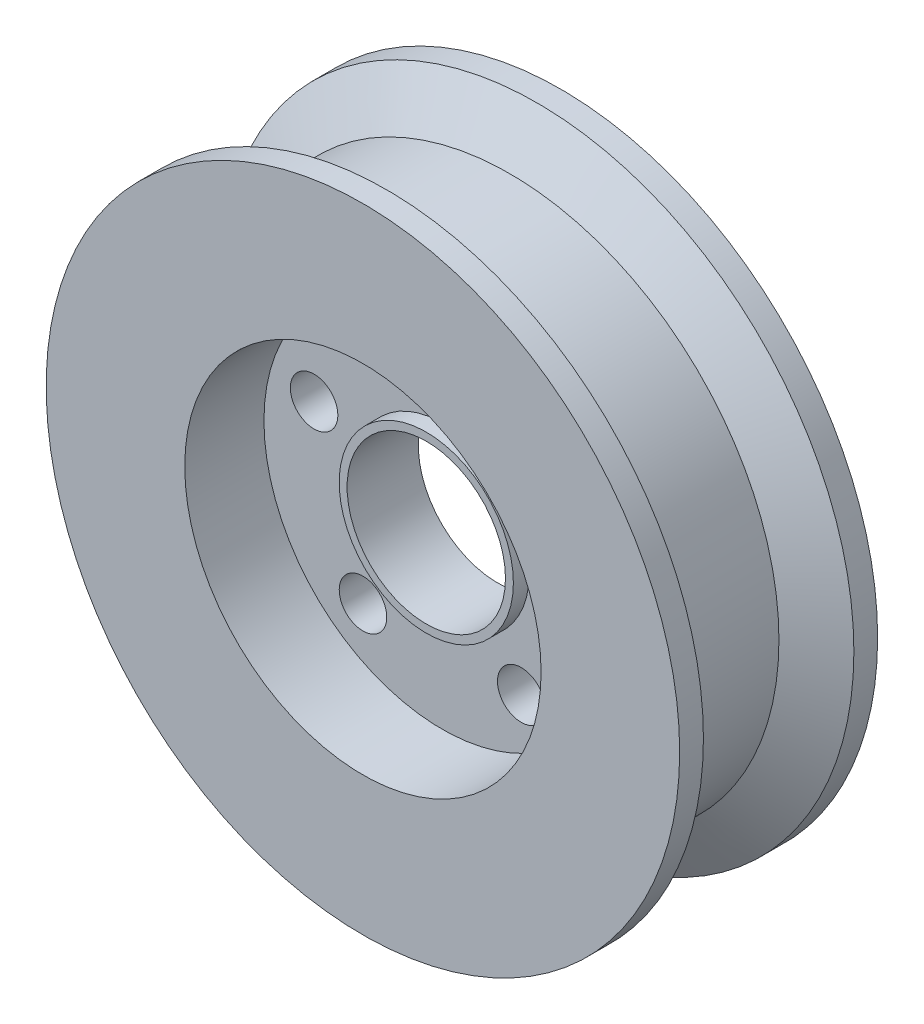
ISO-10303-21;
HEADER;
FILE_DESCRIPTION(('STEP AP214'),'2;1');
FILE_NAME('part.step','',(''),(''),'','','');
FILE_SCHEMA(('AUTOMOTIVE_DESIGN { 1 0 10303 214 1 1 1 1 }'));
ENDSEC;
DATA;
#1=APPLICATION_CONTEXT('core data for automotive mechanical design processes');
#2=APPLICATION_PROTOCOL_DEFINITION('international standard','automotive_design',2000,#1);
#3=PRODUCT_CONTEXT('',#1,'mechanical');
#4=PRODUCT('Part','Part','',(#3));
#5=PRODUCT_RELATED_PRODUCT_CATEGORY('part','',(#4));
#6=PRODUCT_DEFINITION_FORMATION('','',#4);
#7=PRODUCT_DEFINITION_CONTEXT('part definition',#1,'design');
#8=PRODUCT_DEFINITION('design','',#6,#7);
#9=PRODUCT_DEFINITION_SHAPE('','',#8);
#10=(LENGTH_UNIT() NAMED_UNIT(*) SI_UNIT(.MILLI.,.METRE.));
#11=(NAMED_UNIT(*) PLANE_ANGLE_UNIT() SI_UNIT($,.RADIAN.));
#12=(NAMED_UNIT(*) SI_UNIT($,.STERADIAN.) SOLID_ANGLE_UNIT());
#13=UNCERTAINTY_MEASURE_WITH_UNIT(LENGTH_MEASURE(1.E-05),#10,'distance_accuracy_value','');
#14=(GEOMETRIC_REPRESENTATION_CONTEXT(3) GLOBAL_UNCERTAINTY_ASSIGNED_CONTEXT((#13)) GLOBAL_UNIT_ASSIGNED_CONTEXT((#10,
#11,#12)) REPRESENTATION_CONTEXT('',''));
#15=CARTESIAN_POINT('',(0.,0.,0.));
#16=DIRECTION('',(0.,0.,1.));
#17=DIRECTION('',(1.,0.,0.));
#18=AXIS2_PLACEMENT_3D('',#15,#16,#17);
#19=CARTESIAN_POINT('',(0.,0.,12.5));
#20=DIRECTION('',(0.,0.,-1.));
#21=DIRECTION('',(-1.,0.,0.));
#22=AXIS2_PLACEMENT_3D('',#19,#20,#21);
#23=CYLINDRICAL_SURFACE('',#22,40.);
#24=CARTESIAN_POINT('',(0.,0.,-12.5));
#25=DIRECTION('',(0.,0.,1.));
#26=DIRECTION('',(1.,0.,0.));
#27=AXIS2_PLACEMENT_3D('',#24,#25,#26);
#28=CIRCLE('',#27,40.);
#29=CARTESIAN_POINT('',(40.,0.,-12.5));
#30=VERTEX_POINT('',#29);
#31=EDGE_CURVE('E95',#30,#30,#28,.T.);
#32=ORIENTED_EDGE('',*,*,#31,.T.);
#33=EDGE_LOOP('',(#32));
#34=FACE_BOUND('',#33,.T.);
#35=CARTESIAN_POINT('',(0.,0.,-9.5));
#36=DIRECTION('',(0.,0.,1.));
#37=DIRECTION('',(1.,0.,0.));
#38=AXIS2_PLACEMENT_3D('',#35,#36,#37);
#39=CIRCLE('',#38,40.);
#40=CARTESIAN_POINT('',(40.,0.,-9.5));
#41=VERTEX_POINT('',#40);
#42=EDGE_CURVE('E160',#41,#41,#39,.T.);
#43=ORIENTED_EDGE('',*,*,#42,.F.);
#44=EDGE_LOOP('',(#43));
#45=FACE_BOUND('',#44,.T.);
#46=ADVANCED_FACE('F41',(#34,#45),#23,.T.);
#47=CARTESIAN_POINT('',(0.,0.,12.5));
#48=DIRECTION('',(0.,0.,1.));
#49=DIRECTION('',(1.,0.,0.));
#50=AXIS2_PLACEMENT_3D('',#47,#48,#49);
#51=CIRCLE('',#50,40.);
#52=CARTESIAN_POINT('',(40.,0.,12.5));
#53=VERTEX_POINT('',#52);
#54=EDGE_CURVE('E54',#53,#53,#51,.T.);
#55=ORIENTED_EDGE('',*,*,#54,.F.);
#56=EDGE_LOOP('',(#55));
#57=FACE_BOUND('',#56,.T.);
#58=CARTESIAN_POINT('',(0.,0.,9.5));
#59=DIRECTION('',(0.,0.,1.));
#60=DIRECTION('',(1.,0.,0.));
#61=AXIS2_PLACEMENT_3D('',#58,#59,#60);
#62=CIRCLE('',#61,40.);
#63=CARTESIAN_POINT('',(40.,0.,9.5));
#64=VERTEX_POINT('',#63);
#65=EDGE_CURVE('E243',#64,#64,#62,.T.);
#66=ORIENTED_EDGE('',*,*,#65,.T.);
#67=EDGE_LOOP('',(#66));
#68=FACE_BOUND('',#67,.T.);
#69=ADVANCED_FACE('F157',(#57,#68),#23,.T.);
#70=CARTESIAN_POINT('',(0.,0.,12.5));
#71=DIRECTION('',(0.,0.,1.));
#72=DIRECTION('',(1.,0.,0.));
#73=AXIS2_PLACEMENT_3D('',#70,#71,#72);
#74=PLANE('',#73);
#75=CARTESIAN_POINT('',(0.,0.,12.5));
#76=DIRECTION('',(0.,0.,1.));
#77=DIRECTION('',(1.,0.,0.));
#78=AXIS2_PLACEMENT_3D('',#75,#76,#77);
#79=CIRCLE('',#78,22.5);
#80=CARTESIAN_POINT('',(22.5,0.,12.5));
#81=VERTEX_POINT('',#80);
#82=EDGE_CURVE('E86',#81,#81,#79,.T.);
#83=ORIENTED_EDGE('',*,*,#82,.F.);
#84=EDGE_LOOP('',(#83));
#85=FACE_BOUND('',#84,.T.);
#86=ORIENTED_EDGE('',*,*,#54,.T.);
#87=EDGE_LOOP('',(#86));
#88=FACE_BOUND('',#87,.T.);
#89=ADVANCED_FACE('F152',(#85,#88),#74,.T.);
#90=CARTESIAN_POINT('',(0.,0.,-12.5));
#91=DIRECTION('',(0.,0.,1.));
#92=DIRECTION('',(1.,0.,0.));
#93=AXIS2_PLACEMENT_3D('',#90,#91,#92);
#94=PLANE('',#93);
#95=CARTESIAN_POINT('',(0.,0.,-12.5));
#96=DIRECTION('',(0.,0.,1.));
#97=DIRECTION('',(1.,0.,0.));
#98=AXIS2_PLACEMENT_3D('',#95,#96,#97);
#99=CIRCLE('',#98,22.5);
#100=CARTESIAN_POINT('',(22.5,0.,-12.5));
#101=VERTEX_POINT('',#100);
#102=EDGE_CURVE('E87',#101,#101,#99,.T.);
#103=ORIENTED_EDGE('',*,*,#102,.T.);
#104=EDGE_LOOP('',(#103));
#105=FACE_BOUND('',#104,.T.);
#106=ORIENTED_EDGE('',*,*,#31,.F.);
#107=EDGE_LOOP('',(#106));
#108=FACE_BOUND('',#107,.T.);
#109=ADVANCED_FACE('F148',(#105,#108),#94,.F.);
#110=CARTESIAN_POINT('',(0.,0.,2.5));
#111=DIRECTION('',(0.,0.,1.));
#112=DIRECTION('',(1.,0.,0.));
#113=AXIS2_PLACEMENT_3D('',#110,#111,#112);
#114=CYLINDRICAL_SURFACE('',#113,22.5);
#115=CARTESIAN_POINT('',(0.,0.,2.5));
#116=DIRECTION('',(0.,0.,1.));
#117=DIRECTION('',(1.,0.,0.));
#118=AXIS2_PLACEMENT_3D('',#115,#116,#117);
#119=CIRCLE('',#118,22.5);
#120=CARTESIAN_POINT('',(22.5,0.,2.5));
#121=VERTEX_POINT('',#120);
#122=EDGE_CURVE('E91',#121,#121,#119,.T.);
#123=ORIENTED_EDGE('',*,*,#122,.F.);
#124=EDGE_LOOP('',(#123));
#125=FACE_BOUND('',#124,.T.);
#126=ORIENTED_EDGE('',*,*,#82,.T.);
#127=EDGE_LOOP('',(#126));
#128=FACE_BOUND('',#127,.T.);
#129=ADVANCED_FACE('F151',(#125,#128),#114,.F.);
#130=CARTESIAN_POINT('',(0.,0.,2.5));
#131=DIRECTION('',(0.,0.,1.));
#132=DIRECTION('',(1.,0.,0.));
#133=AXIS2_PLACEMENT_3D('',#130,#131,#132);
#134=PLANE('',#133);
#135=CARTESIAN_POINT('',(0.,0.,2.5));
#136=DIRECTION('',(0.,0.,1.));
#137=DIRECTION('',(1.,0.,0.));
#138=AXIS2_PLACEMENT_3D('',#135,#136,#137);
#139=CIRCLE('',#138,11.);
#140=CARTESIAN_POINT('',(11.,0.,2.5));
#141=VERTEX_POINT('',#140);
#142=EDGE_CURVE('E10',#141,#141,#139,.T.);
#143=ORIENTED_EDGE('',*,*,#142,.F.);
#144=EDGE_LOOP('',(#143));
#145=FACE_BOUND('',#144,.T.);
#146=CARTESIAN_POINT('',(-16.1679607770176,5.25328890437406,2.5));
#147=DIRECTION('',(0.,0.,1.));
#148=DIRECTION('',(0.309016994374945,0.951056516295155,0.));
#149=AXIS2_PLACEMENT_3D('',#146,#147,#148);
#150=CIRCLE('',#149,3.);
#151=CARTESIAN_POINT('',(-15.2409097938928,8.10645845325953,2.5));
#152=VERTEX_POINT('',#151);
#153=EDGE_CURVE('E59',#152,#152,#150,.T.);
#154=ORIENTED_EDGE('',*,*,#153,.F.);
#155=EDGE_LOOP('',(#154));
#156=FACE_BOUND('',#155,.T.);
#157=CARTESIAN_POINT('',(-9.99234928897197,-13.7532889043742,2.5));
#158=DIRECTION('',(0.,0.,1.));
#159=DIRECTION('',(-0.809016994374951,0.587785252292469,0.));
#160=AXIS2_PLACEMENT_3D('',#157,#158,#159);
#161=CIRCLE('',#160,3.);
#162=CARTESIAN_POINT('',(-12.4194002720968,-11.9899331474968,2.5));
#163=VERTEX_POINT('',#162);
#164=EDGE_CURVE('E64',#163,#163,#161,.T.);
#165=ORIENTED_EDGE('',*,*,#164,.F.);
#166=EDGE_LOOP('',(#165));
#167=FACE_BOUND('',#166,.T.);
#168=CARTESIAN_POINT('',(9.99234928897216,-13.753288904374,2.5));
#169=DIRECTION('',(0.,0.,1.));
#170=DIRECTION('',(-0.809016994374942,-0.58778525229248,0.));
#171=AXIS2_PLACEMENT_3D('',#168,#169,#170);
#172=CIRCLE('',#171,3.);
#173=CARTESIAN_POINT('',(7.56529830584734,-15.5166446612515,2.5));
#174=VERTEX_POINT('',#173);
#175=EDGE_CURVE('E68',#174,#174,#172,.T.);
#176=ORIENTED_EDGE('',*,*,#175,.F.);
#177=EDGE_LOOP('',(#176));
#178=FACE_BOUND('',#177,.T.);
#179=CARTESIAN_POINT('',(16.1679607770176,5.25328890437429,2.5));
#180=DIRECTION('',(0.,0.,1.));
#181=DIRECTION('',(0.309016994374958,-0.95105651629515,0.));
#182=AXIS2_PLACEMENT_3D('',#179,#180,#181);
#183=CIRCLE('',#182,3.);
#184=CARTESIAN_POINT('',(17.0950117601424,2.40011935548884,2.5));
#185=VERTEX_POINT('',#184);
#186=EDGE_CURVE('E72',#185,#185,#183,.T.);
#187=ORIENTED_EDGE('',*,*,#186,.F.);
#188=EDGE_LOOP('',(#187));
#189=FACE_BOUND('',#188,.T.);
#190=CARTESIAN_POINT('',(0.,17.,2.5));
#191=DIRECTION('',(0.,0.,1.));
#192=DIRECTION('',(1.,0.,0.));
#193=AXIS2_PLACEMENT_3D('',#190,#191,#192);
#194=CIRCLE('',#193,3.);
#195=CARTESIAN_POINT('',(3.,17.,2.5));
#196=VERTEX_POINT('',#195);
#197=EDGE_CURVE('E76',#196,#196,#194,.T.);
#198=ORIENTED_EDGE('',*,*,#197,.F.);
#199=EDGE_LOOP('',(#198));
#200=FACE_BOUND('',#199,.T.);
#201=ORIENTED_EDGE('',*,*,#122,.T.);
#202=EDGE_LOOP('',(#201));
#203=FACE_BOUND('',#202,.T.);
#204=ADVANCED_FACE('F144',(#145,#156,#167,#178,#189,#200,#203),#134,.T.);
#205=CARTESIAN_POINT('',(0.,0.,-2.5));
#206=DIRECTION('',(0.,0.,-1.));
#207=DIRECTION('',(-1.,0.,0.));
#208=AXIS2_PLACEMENT_3D('',#205,#206,#207);
#209=CYLINDRICAL_SURFACE('',#208,22.5);
#210=CARTESIAN_POINT('',(0.,0.,-2.5));
#211=DIRECTION('',(0.,0.,1.));
#212=DIRECTION('',(1.,0.,0.));
#213=AXIS2_PLACEMENT_3D('',#210,#211,#212);
#214=CIRCLE('',#213,22.5);
#215=CARTESIAN_POINT('',(22.5,0.,-2.5));
#216=VERTEX_POINT('',#215);
#217=EDGE_CURVE('E82',#216,#216,#214,.T.);
#218=ORIENTED_EDGE('',*,*,#217,.T.);
#219=EDGE_LOOP('',(#218));
#220=FACE_BOUND('',#219,.T.);
#221=ORIENTED_EDGE('',*,*,#102,.F.);
#222=EDGE_LOOP('',(#221));
#223=FACE_BOUND('',#222,.T.);
#224=ADVANCED_FACE('F129',(#220,#223),#209,.F.);
#225=CARTESIAN_POINT('',(0.,0.,-2.5));
#226=DIRECTION('',(0.,0.,-1.));
#227=DIRECTION('',(1.,0.,0.));
#228=AXIS2_PLACEMENT_3D('',#225,#226,#227);
#229=PLANE('',#228);
#230=CARTESIAN_POINT('',(0.,0.,-2.5));
#231=DIRECTION('',(0.,0.,-1.));
#232=DIRECTION('',(-1.,0.,0.));
#233=AXIS2_PLACEMENT_3D('',#230,#231,#232);
#234=CIRCLE('',#233,11.);
#235=CARTESIAN_POINT('',(-11.,0.,-2.5));
#236=VERTEX_POINT('',#235);
#237=EDGE_CURVE('E44',#236,#236,#234,.T.);
#238=ORIENTED_EDGE('',*,*,#237,.F.);
#239=EDGE_LOOP('',(#238));
#240=FACE_BOUND('',#239,.T.);
#241=CARTESIAN_POINT('',(-16.1679607770176,5.25328890437406,-2.5));
#242=DIRECTION('',(0.,0.,-1.));
#243=DIRECTION('',(-1.,0.,0.));
#244=AXIS2_PLACEMENT_3D('',#241,#242,#243);
#245=CIRCLE('',#244,3.);
#246=CARTESIAN_POINT('',(-19.1679607770176,5.25328890437406,-2.5));
#247=VERTEX_POINT('',#246);
#248=EDGE_CURVE('E81',#247,#247,#245,.T.);
#249=ORIENTED_EDGE('',*,*,#248,.F.);
#250=EDGE_LOOP('',(#249));
#251=FACE_BOUND('',#250,.T.);
#252=CARTESIAN_POINT('',(-9.99234928897197,-13.7532889043742,-2.5));
#253=DIRECTION('',(0.,0.,-1.));
#254=DIRECTION('',(-1.,0.,0.));
#255=AXIS2_PLACEMENT_3D('',#252,#253,#254);
#256=CIRCLE('',#255,3.);
#257=CARTESIAN_POINT('',(-12.992349288972,-13.7532889043742,-2.5));
#258=VERTEX_POINT('',#257);
#259=EDGE_CURVE('E115',#258,#258,#256,.T.);
#260=ORIENTED_EDGE('',*,*,#259,.F.);
#261=EDGE_LOOP('',(#260));
#262=FACE_BOUND('',#261,.T.);
#263=CARTESIAN_POINT('',(9.99234928897216,-13.753288904374,-2.5));
#264=DIRECTION('',(0.,0.,-1.));
#265=DIRECTION('',(-1.,0.,0.));
#266=AXIS2_PLACEMENT_3D('',#263,#264,#265);
#267=CIRCLE('',#266,3.);
#268=CARTESIAN_POINT('',(6.99234928897217,-13.753288904374,-2.5));
#269=VERTEX_POINT('',#268);
#270=EDGE_CURVE('E111',#269,#269,#267,.T.);
#271=ORIENTED_EDGE('',*,*,#270,.F.);
#272=EDGE_LOOP('',(#271));
#273=FACE_BOUND('',#272,.T.);
#274=CARTESIAN_POINT('',(16.1679607770176,5.25328890437429,-2.5));
#275=DIRECTION('',(0.,0.,-1.));
#276=DIRECTION('',(-1.,0.,0.));
#277=AXIS2_PLACEMENT_3D('',#274,#275,#276);
#278=CIRCLE('',#277,3.);
#279=CARTESIAN_POINT('',(13.1679607770176,5.25328890437429,-2.5));
#280=VERTEX_POINT('',#279);
#281=EDGE_CURVE('E63',#280,#280,#278,.T.);
#282=ORIENTED_EDGE('',*,*,#281,.F.);
#283=EDGE_LOOP('',(#282));
#284=FACE_BOUND('',#283,.T.);
#285=CARTESIAN_POINT('',(0.,17.,-2.5));
#286=DIRECTION('',(0.,0.,-1.));
#287=DIRECTION('',(-1.,0.,0.));
#288=AXIS2_PLACEMENT_3D('',#285,#286,#287);
#289=CIRCLE('',#288,3.);
#290=CARTESIAN_POINT('',(-3.,17.,-2.5));
#291=VERTEX_POINT('',#290);
#292=EDGE_CURVE('E80',#291,#291,#289,.T.);
#293=ORIENTED_EDGE('',*,*,#292,.F.);
#294=EDGE_LOOP('',(#293));
#295=FACE_BOUND('',#294,.T.);
#296=ORIENTED_EDGE('',*,*,#217,.F.);
#297=EDGE_LOOP('',(#296));
#298=FACE_BOUND('',#297,.T.);
#299=ADVANCED_FACE('F125',(#240,#251,#262,#273,#284,#295,#298),#229,.T.);
#300=CARTESIAN_POINT('',(0.,17.,-12.5));
#301=DIRECTION('',(0.,0.,1.));
#302=DIRECTION('',(1.,0.,0.));
#303=AXIS2_PLACEMENT_3D('',#300,#301,#302);
#304=CYLINDRICAL_SURFACE('',#303,3.);
#305=ORIENTED_EDGE('',*,*,#292,.T.);
#306=EDGE_LOOP('',(#305));
#307=FACE_BOUND('',#306,.T.);
#308=ORIENTED_EDGE('',*,*,#197,.T.);
#309=EDGE_LOOP('',(#308));
#310=FACE_BOUND('',#309,.T.);
#311=ADVANCED_FACE('F128',(#307,#310),#304,.F.);
#312=CARTESIAN_POINT('',(16.1679607770176,5.25328890437429,-12.5));
#313=DIRECTION('',(0.,0.,1.));
#314=DIRECTION('',(1.,0.,0.));
#315=AXIS2_PLACEMENT_3D('',#312,#313,#314);
#316=CYLINDRICAL_SURFACE('',#315,3.);
#317=ORIENTED_EDGE('',*,*,#281,.T.);
#318=EDGE_LOOP('',(#317));
#319=FACE_BOUND('',#318,.T.);
#320=ORIENTED_EDGE('',*,*,#186,.T.);
#321=EDGE_LOOP('',(#320));
#322=FACE_BOUND('',#321,.T.);
#323=ADVANCED_FACE('F212',(#319,#322),#316,.F.);
#324=CARTESIAN_POINT('',(9.99234928897216,-13.753288904374,-12.5));
#325=DIRECTION('',(0.,0.,1.));
#326=DIRECTION('',(1.,0.,0.));
#327=AXIS2_PLACEMENT_3D('',#324,#325,#326);
#328=CYLINDRICAL_SURFACE('',#327,3.);
#329=ORIENTED_EDGE('',*,*,#270,.T.);
#330=EDGE_LOOP('',(#329));
#331=FACE_BOUND('',#330,.T.);
#332=ORIENTED_EDGE('',*,*,#175,.T.);
#333=EDGE_LOOP('',(#332));
#334=FACE_BOUND('',#333,.T.);
#335=ADVANCED_FACE('F208',(#331,#334),#328,.F.);
#336=CARTESIAN_POINT('',(-9.99234928897197,-13.7532889043742,-12.5));
#337=DIRECTION('',(0.,0.,1.));
#338=DIRECTION('',(1.,0.,0.));
#339=AXIS2_PLACEMENT_3D('',#336,#337,#338);
#340=CYLINDRICAL_SURFACE('',#339,3.);
#341=ORIENTED_EDGE('',*,*,#259,.T.);
#342=EDGE_LOOP('',(#341));
#343=FACE_BOUND('',#342,.T.);
#344=ORIENTED_EDGE('',*,*,#164,.T.);
#345=EDGE_LOOP('',(#344));
#346=FACE_BOUND('',#345,.T.);
#347=ADVANCED_FACE('F205',(#343,#346),#340,.F.);
#348=CARTESIAN_POINT('',(-16.1679607770176,5.25328890437406,-12.5));
#349=DIRECTION('',(0.,0.,1.));
#350=DIRECTION('',(1.,0.,0.));
#351=AXIS2_PLACEMENT_3D('',#348,#349,#350);
#352=CYLINDRICAL_SURFACE('',#351,3.);
#353=ORIENTED_EDGE('',*,*,#248,.T.);
#354=EDGE_LOOP('',(#353));
#355=FACE_BOUND('',#354,.T.);
#356=ORIENTED_EDGE('',*,*,#153,.T.);
#357=EDGE_LOOP('',(#356));
#358=FACE_BOUND('',#357,.T.);
#359=ADVANCED_FACE('F122',(#355,#358),#352,.F.);
#360=CARTESIAN_POINT('',(0.,0.,-4.5));
#361=DIRECTION('',(0.,0.,1.));
#362=DIRECTION('',(1.,0.,0.));
#363=AXIS2_PLACEMENT_3D('',#360,#361,#362);
#364=CYLINDRICAL_SURFACE('',#363,11.);
#365=ORIENTED_EDGE('',*,*,#237,.T.);
#366=EDGE_LOOP('',(#365));
#367=FACE_BOUND('',#366,.T.);
#368=CARTESIAN_POINT('',(0.,0.,-4.5));
#369=DIRECTION('',(0.,0.,1.));
#370=DIRECTION('',(1.,0.,0.));
#371=AXIS2_PLACEMENT_3D('',#368,#369,#370);
#372=CIRCLE('',#371,11.);
#373=CARTESIAN_POINT('',(11.,0.,-4.5));
#374=VERTEX_POINT('',#373);
#375=EDGE_CURVE('E57',#374,#374,#372,.T.);
#376=ORIENTED_EDGE('',*,*,#375,.T.);
#377=EDGE_LOOP('',(#376));
#378=FACE_BOUND('',#377,.T.);
#379=ADVANCED_FACE('F187',(#367,#378),#364,.T.);
#380=CARTESIAN_POINT('',(0.,0.,-4.5));
#381=DIRECTION('',(0.,0.,1.));
#382=DIRECTION('',(1.,0.,0.));
#383=AXIS2_PLACEMENT_3D('',#380,#381,#382);
#384=PLANE('',#383);
#385=CARTESIAN_POINT('',(0.,0.,-4.5));
#386=DIRECTION('',(0.,0.,1.));
#387=DIRECTION('',(1.,0.,0.));
#388=AXIS2_PLACEMENT_3D('',#385,#386,#387);
#389=CIRCLE('',#388,10.);
#390=CARTESIAN_POINT('',(10.,0.,-4.5));
#391=VERTEX_POINT('',#390);
#392=EDGE_CURVE('E178',#391,#391,#389,.T.);
#393=ORIENTED_EDGE('',*,*,#392,.T.);
#394=EDGE_LOOP('',(#393));
#395=FACE_BOUND('',#394,.T.);
#396=ORIENTED_EDGE('',*,*,#375,.F.);
#397=EDGE_LOOP('',(#396));
#398=FACE_BOUND('',#397,.T.);
#399=ADVANCED_FACE('F189',(#395,#398),#384,.F.);
#400=ORIENTED_EDGE('',*,*,#142,.T.);
#401=EDGE_LOOP('',(#400));
#402=FACE_BOUND('',#401,.T.);
#403=CARTESIAN_POINT('',(0.,0.,4.5));
#404=DIRECTION('',(0.,0.,1.));
#405=DIRECTION('',(1.,0.,0.));
#406=AXIS2_PLACEMENT_3D('',#403,#404,#405);
#407=CIRCLE('',#406,11.);
#408=CARTESIAN_POINT('',(11.,0.,4.5));
#409=VERTEX_POINT('',#408);
#410=EDGE_CURVE('E169',#409,#409,#407,.T.);
#411=ORIENTED_EDGE('',*,*,#410,.F.);
#412=EDGE_LOOP('',(#411));
#413=FACE_BOUND('',#412,.T.);
#414=ADVANCED_FACE('F191',(#402,#413),#364,.T.);
#415=CARTESIAN_POINT('',(0.,0.,4.5));
#416=DIRECTION('',(0.,0.,1.));
#417=DIRECTION('',(1.,0.,0.));
#418=AXIS2_PLACEMENT_3D('',#415,#416,#417);
#419=PLANE('',#418);
#420=ORIENTED_EDGE('',*,*,#410,.T.);
#421=EDGE_LOOP('',(#420));
#422=FACE_BOUND('',#421,.T.);
#423=CARTESIAN_POINT('',(0.,0.,4.5));
#424=DIRECTION('',(0.,0.,1.));
#425=DIRECTION('',(1.,0.,0.));
#426=AXIS2_PLACEMENT_3D('',#423,#424,#425);
#427=CIRCLE('',#426,10.);
#428=CARTESIAN_POINT('',(10.,0.,4.5));
#429=VERTEX_POINT('',#428);
#430=EDGE_CURVE('E163',#429,#429,#427,.T.);
#431=ORIENTED_EDGE('',*,*,#430,.F.);
#432=EDGE_LOOP('',(#431));
#433=FACE_BOUND('',#432,.T.);
#434=ADVANCED_FACE('F197',(#422,#433),#419,.T.);
#435=CARTESIAN_POINT('',(0.,0.,12.5));
#436=DIRECTION('',(0.,0.,-1.));
#437=DIRECTION('',(-1.,0.,0.));
#438=AXIS2_PLACEMENT_3D('',#435,#436,#437);
#439=CYLINDRICAL_SURFACE('',#438,10.);
#440=ORIENTED_EDGE('',*,*,#392,.F.);
#441=EDGE_LOOP('',(#440));
#442=FACE_BOUND('',#441,.T.);
#443=ORIENTED_EDGE('',*,*,#430,.T.);
#444=EDGE_LOOP('',(#443));
#445=FACE_BOUND('',#444,.T.);
#446=ADVANCED_FACE('F226',(#442,#445),#439,.F.);
#447=CARTESIAN_POINT('',(0.,0.,-6.03589838486221));
#448=DIRECTION('',(0.,0.,-1.));
#449=DIRECTION('',(-1.,0.,0.));
#450=AXIS2_PLACEMENT_3D('',#447,#448,#449);
#451=CONICAL_SURFACE('',#450,34.,1.04719755119659);
#452=ORIENTED_EDGE('',*,*,#42,.T.);
#453=EDGE_LOOP('',(#452));
#454=FACE_BOUND('',#453,.T.);
#455=CARTESIAN_POINT('',(0.,0.,-6.03589838486221));
#456=DIRECTION('',(0.,0.,1.));
#457=DIRECTION('',(1.,0.,0.));
#458=AXIS2_PLACEMENT_3D('',#455,#456,#457);
#459=CIRCLE('',#458,34.);
#460=CARTESIAN_POINT('',(34.,0.,-6.03589838486221));
#461=VERTEX_POINT('',#460);
#462=EDGE_CURVE('E164',#461,#461,#459,.T.);
#463=ORIENTED_EDGE('',*,*,#462,.F.);
#464=EDGE_LOOP('',(#463));
#465=FACE_BOUND('',#464,.T.);
#466=ADVANCED_FACE('F229',(#454,#465),#451,.T.);
#467=CARTESIAN_POINT('',(0.,0.,0.));
#468=DIRECTION('',(0.,0.,1.));
#469=DIRECTION('',(1.,0.,0.));
#470=AXIS2_PLACEMENT_3D('',#467,#468,#469);
#471=CYLINDRICAL_SURFACE('',#470,34.);
#472=ORIENTED_EDGE('',*,*,#462,.T.);
#473=EDGE_LOOP('',(#472));
#474=FACE_BOUND('',#473,.T.);
#475=CARTESIAN_POINT('',(0.,0.,6.03589838486221));
#476=DIRECTION('',(0.,0.,1.));
#477=DIRECTION('',(1.,0.,0.));
#478=AXIS2_PLACEMENT_3D('',#475,#476,#477);
#479=CIRCLE('',#478,34.);
#480=CARTESIAN_POINT('',(34.,0.,6.03589838486221));
#481=VERTEX_POINT('',#480);
#482=EDGE_CURVE('E172',#481,#481,#479,.T.);
#483=ORIENTED_EDGE('',*,*,#482,.F.);
#484=EDGE_LOOP('',(#483));
#485=FACE_BOUND('',#484,.T.);
#486=ADVANCED_FACE('F253',(#474,#485),#471,.T.);
#487=CARTESIAN_POINT('',(0.,0.,9.5));
#488=DIRECTION('',(0.,0.,1.));
#489=DIRECTION('',(1.,0.,0.));
#490=AXIS2_PLACEMENT_3D('',#487,#488,#489);
#491=CONICAL_SURFACE('',#490,40.,1.04719755119659);
#492=ORIENTED_EDGE('',*,*,#482,.T.);
#493=EDGE_LOOP('',(#492));
#494=FACE_BOUND('',#493,.T.);
#495=ORIENTED_EDGE('',*,*,#65,.F.);
#496=EDGE_LOOP('',(#495));
#497=FACE_BOUND('',#496,.T.);
#498=ADVANCED_FACE('F251',(#494,#497),#491,.T.);
#499=CLOSED_SHELL('',(#46,#69,#89,#109,#129,#204,#224,#299,#311,#323,#335,#347,#359,#379,#399,
#414,#434,#446,#466,#486,#498));
#500=MANIFOLD_SOLID_BREP('B2',#499);
#501=ADVANCED_BREP_SHAPE_REPRESENTATION('',(#18,#500),#14);
#502=SHAPE_DEFINITION_REPRESENTATION(#9,#501);
ENDSEC;
END-ISO-10303-21;
